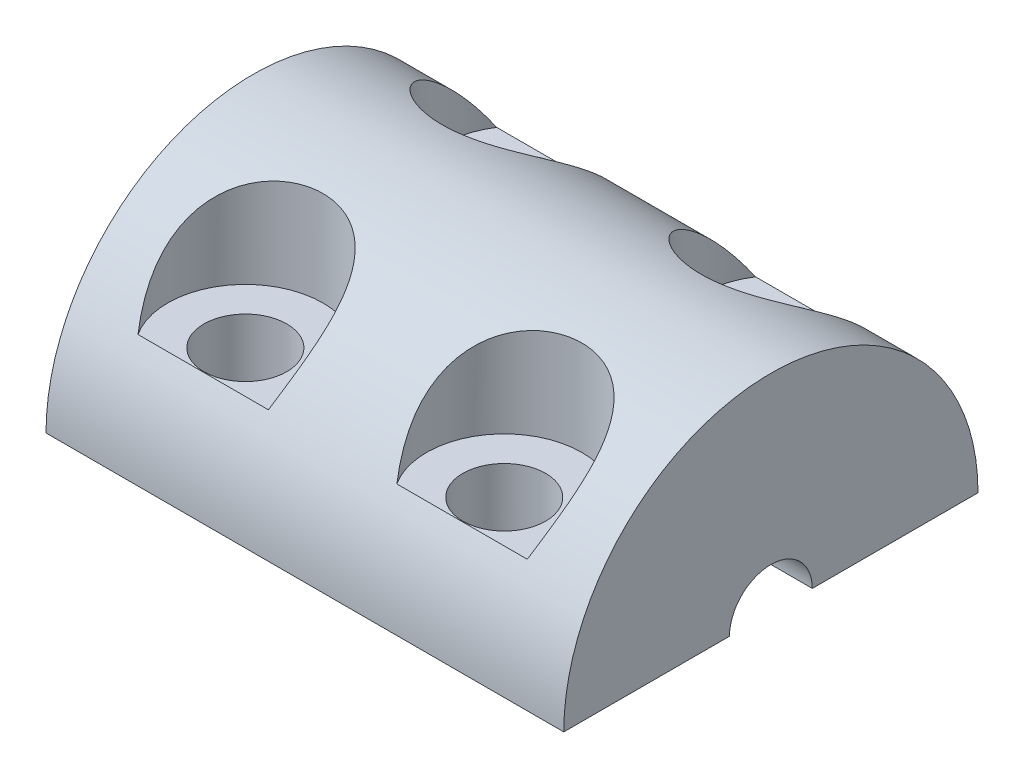
ISO-10303-21;
HEADER;
FILE_DESCRIPTION(('STEP AP214'),'2;1');
FILE_NAME('part.step','',(''),(''),'','','');
FILE_SCHEMA(('AUTOMOTIVE_DESIGN { 1 0 10303 214 1 1 1 1 }'));
ENDSEC;
DATA;
#1=APPLICATION_CONTEXT('core data for automotive mechanical design processes');
#2=APPLICATION_PROTOCOL_DEFINITION('international standard','automotive_design',2000,#1);
#3=PRODUCT_CONTEXT('',#1,'mechanical');
#4=PRODUCT('Part','Part','',(#3));
#5=PRODUCT_RELATED_PRODUCT_CATEGORY('part','',(#4));
#6=PRODUCT_DEFINITION_FORMATION('','',#4);
#7=PRODUCT_DEFINITION_CONTEXT('part definition',#1,'design');
#8=PRODUCT_DEFINITION('design','',#6,#7);
#9=PRODUCT_DEFINITION_SHAPE('','',#8);
#10=(LENGTH_UNIT() NAMED_UNIT(*) SI_UNIT(.MILLI.,.METRE.));
#11=(NAMED_UNIT(*) PLANE_ANGLE_UNIT() SI_UNIT($,.RADIAN.));
#12=(NAMED_UNIT(*) SI_UNIT($,.STERADIAN.) SOLID_ANGLE_UNIT());
#13=UNCERTAINTY_MEASURE_WITH_UNIT(LENGTH_MEASURE(1.E-05),#10,'distance_accuracy_value','');
#14=(GEOMETRIC_REPRESENTATION_CONTEXT(3) GLOBAL_UNCERTAINTY_ASSIGNED_CONTEXT((#13)) GLOBAL_UNIT_ASSIGNED_CONTEXT((#10,
#11,#12)) REPRESENTATION_CONTEXT('',''));
#15=CARTESIAN_POINT('',(0.,0.,0.));
#16=DIRECTION('',(0.,0.,1.));
#17=DIRECTION('',(1.,0.,0.));
#18=AXIS2_PLACEMENT_3D('',#15,#16,#17);
#19=CARTESIAN_POINT('',(-5.,10.,5.3));
#20=DIRECTION('',(0.,-1.,0.));
#21=DIRECTION('',(0.,0.,-1.));
#22=AXIS2_PLACEMENT_3D('',#19,#20,#21);
#23=CYLINDRICAL_SURFACE('',#22,1.6);
#24=CARTESIAN_POINT('',(-5.,0.,5.3));
#25=DIRECTION('',(0.,-1.,0.));
#26=DIRECTION('',(0.,0.,-1.));
#27=AXIS2_PLACEMENT_3D('',#24,#25,#26);
#28=CIRCLE('',#27,1.6);
#29=CARTESIAN_POINT('',(-5.,0.,3.7));
#30=VERTEX_POINT('',#29);
#31=EDGE_CURVE('E189',#30,#30,#28,.T.);
#32=ORIENTED_EDGE('',*,*,#31,.T.);
#33=EDGE_LOOP('',(#32));
#34=FACE_BOUND('',#33,.T.);
#35=CARTESIAN_POINT('',(-5.,4.,5.3));
#36=DIRECTION('',(0.,1.,0.));
#37=DIRECTION('',(0.,0.,1.));
#38=AXIS2_PLACEMENT_3D('',#35,#36,#37);
#39=CIRCLE('',#38,1.6);
#40=CARTESIAN_POINT('',(-5.,4.,6.9));
#41=VERTEX_POINT('',#40);
#42=EDGE_CURVE('E125',#41,#41,#39,.F.);
#43=ORIENTED_EDGE('',*,*,#42,.F.);
#44=EDGE_LOOP('',(#43));
#45=FACE_BOUND('',#44,.T.);
#46=ADVANCED_FACE('F39',(#34,#45),#23,.F.);
#47=CARTESIAN_POINT('',(5.,10.,5.3));
#48=DIRECTION('',(0.,-1.,0.));
#49=DIRECTION('',(0.,0.,-1.));
#50=AXIS2_PLACEMENT_3D('',#47,#48,#49);
#51=CYLINDRICAL_SURFACE('',#50,1.6);
#52=CARTESIAN_POINT('',(5.,0.,5.3));
#53=DIRECTION('',(0.,-1.,0.));
#54=DIRECTION('',(0.,0.,-1.));
#55=AXIS2_PLACEMENT_3D('',#52,#53,#54);
#56=CIRCLE('',#55,1.6);
#57=CARTESIAN_POINT('',(5.,0.,3.7));
#58=VERTEX_POINT('',#57);
#59=EDGE_CURVE('E293',#58,#58,#56,.T.);
#60=ORIENTED_EDGE('',*,*,#59,.T.);
#61=EDGE_LOOP('',(#60));
#62=FACE_BOUND('',#61,.T.);
#63=CARTESIAN_POINT('',(5.,4.,5.3));
#64=DIRECTION('',(0.,1.,0.));
#65=DIRECTION('',(0.,0.,1.));
#66=AXIS2_PLACEMENT_3D('',#63,#64,#65);
#67=CIRCLE('',#66,1.6);
#68=CARTESIAN_POINT('',(5.,4.,6.9));
#69=VERTEX_POINT('',#68);
#70=EDGE_CURVE('E126',#69,#69,#67,.F.);
#71=ORIENTED_EDGE('',*,*,#70,.F.);
#72=EDGE_LOOP('',(#71));
#73=FACE_BOUND('',#72,.T.);
#74=ADVANCED_FACE('F257',(#62,#73),#51,.F.);
#75=CARTESIAN_POINT('',(0.,0.,0.));
#76=DIRECTION('',(-1.,0.,0.));
#77=DIRECTION('',(0.,0.,1.));
#78=AXIS2_PLACEMENT_3D('',#75,#76,#77);
#79=PLANE('',#78);
#80=CARTESIAN_POINT('',(0.,0.,0.));
#81=DIRECTION('',(1.,0.,0.));
#82=DIRECTION('',(0.,0.,-1.));
#83=AXIS2_PLACEMENT_3D('',#80,#81,#82);
#84=CIRCLE('',#83,2.6);
#85=CARTESIAN_POINT('',(0.,0.,-2.6));
#86=VERTEX_POINT('',#85);
#87=CARTESIAN_POINT('',(0.,0.,2.6));
#88=VERTEX_POINT('',#87);
#89=EDGE_CURVE('E185',#86,#88,#84,.T.);
#90=ORIENTED_EDGE('',*,*,#89,.F.);
#91=DIRECTION('',(0.,0.,-1.));
#92=VECTOR('',#91,1.);
#93=CARTESIAN_POINT('',(0.,0.,-1.6));
#94=LINE('',#93,#92);
#95=CARTESIAN_POINT('',(0.,0.,-1.6));
#96=VERTEX_POINT('',#95);
#97=EDGE_CURVE('E198',#96,#86,#94,.T.);
#98=ORIENTED_EDGE('',*,*,#97,.F.);
#99=CARTESIAN_POINT('',(0.,0.,0.));
#100=DIRECTION('',(-1.,0.,0.));
#101=DIRECTION('',(0.,0.,1.));
#102=AXIS2_PLACEMENT_3D('',#99,#100,#101);
#103=CIRCLE('',#102,1.6);
#104=CARTESIAN_POINT('',(0.,0.,1.6));
#105=VERTEX_POINT('',#104);
#106=EDGE_CURVE('E208',#105,#96,#103,.T.);
#107=ORIENTED_EDGE('',*,*,#106,.F.);
#108=DIRECTION('',(0.,0.,-1.));
#109=VECTOR('',#108,1.);
#110=CARTESIAN_POINT('',(0.,0.,8.));
#111=LINE('',#110,#109);
#112=EDGE_CURVE('E194',#88,#105,#111,.T.);
#113=ORIENTED_EDGE('',*,*,#112,.F.);
#114=EDGE_LOOP('',(#90,#98,#107,#113));
#115=FACE_BOUND('',#114,.T.);
#116=ADVANCED_FACE('F135',(#115),#79,.T.);
#117=CARTESIAN_POINT('',(10.,0.,0.));
#118=DIRECTION('',(-1.,0.,0.));
#119=DIRECTION('',(0.,0.,1.));
#120=AXIS2_PLACEMENT_3D('',#117,#118,#119);
#121=CYLINDRICAL_SURFACE('',#120,8.);
#122=DIRECTION('',(-1.,0.,0.));
#123=VECTOR('',#122,1.);
#124=CARTESIAN_POINT('',(10.,4.,6.92820323027551));
#125=LINE('',#124,#123);
#126=CARTESIAN_POINT('',(2.48028687328887,4.,6.92820323027551));
#127=VERTEX_POINT('',#126);
#128=CARTESIAN_POINT('',(7.51971312671113,4.,6.92820323027551));
#129=VERTEX_POINT('',#128);
#130=EDGE_CURVE('E121',#127,#129,#125,.F.);
#131=ORIENTED_EDGE('',*,*,#130,.F.);
#132=CARTESIAN_POINT('',(2.48028687328887,4.,6.92820323027551));
#133=CARTESIAN_POINT('',(2.42268432999207,4.15447094658286,6.83901770608216));
#134=CARTESIAN_POINT('',(2.36805276425493,4.30691430076104,6.74411586178259));
#135=CARTESIAN_POINT('',(2.26703938800955,4.60748607622435,6.5424738631374));
#136=CARTESIAN_POINT('',(2.22068939040642,4.75559610464146,6.43569051085766));
#137=CARTESIAN_POINT('',(2.13850878615933,5.04787842959176,6.20914603531687));
#138=CARTESIAN_POINT('',(2.1028166248965,5.19197855141819,6.08923963017592));
#139=CARTESIAN_POINT('',(2.04587390447653,5.47270389446106,5.83823069332525));
#140=CARTESIAN_POINT('',(2.02459857240118,5.60934156518667,5.70714780526658));
#141=CARTESIAN_POINT('',(1.9982635506114,5.89137495297147,5.41643556945201));
#142=CARTESIAN_POINT('',(1.99572272413871,6.03553631395531,5.25532422907641));
#143=CARTESIAN_POINT('',(2.01323090911154,6.24065791277609,5.00657304580275));
#144=CARTESIAN_POINT('',(2.0225929368339,6.30709517052098,4.92259481886254));
#145=CARTESIAN_POINT('',(2.04907004215929,6.43597960748785,4.75284032539089));
#146=CARTESIAN_POINT('',(2.06618137059281,6.49842869956293,4.66706494745149));
#147=CARTESIAN_POINT('',(2.10906952238112,6.61973144890119,4.49338680477556));
#148=CARTESIAN_POINT('',(2.13495611621068,6.67852780472331,4.40547088018539));
#149=CARTESIAN_POINT('',(2.19587521188576,6.79120514315229,4.22970684358536));
#150=CARTESIAN_POINT('',(2.23090266592469,6.84508881657105,4.14185872090387));
#151=CARTESIAN_POINT('',(2.31049779230545,6.94764818206895,3.9674202906169));
#152=CARTESIAN_POINT('',(2.35506642216122,6.99632335070767,3.88083011018547));
#153=CARTESIAN_POINT('',(2.45389602415372,7.08821844322346,3.71032806614034));
#154=CARTESIAN_POINT('',(2.50815489736285,7.1314395450102,3.62641562715219));
#155=CARTESIAN_POINT('',(2.61739968892661,7.20626979331868,3.47501200241172));
#156=CARTESIAN_POINT('',(2.67106135109019,7.2386487021071,3.40694276933439));
#157=CARTESIAN_POINT('',(2.78506704409809,7.29941000758085,3.27473733054404));
#158=CARTESIAN_POINT('',(2.84541011597567,7.32779297646896,3.21060056246159));
#159=CARTESIAN_POINT('',(2.97238950457947,7.38064398797913,3.08716745970697));
#160=CARTESIAN_POINT('',(3.03902329740512,7.40511359015702,3.02786920142844));
#161=CARTESIAN_POINT('',(3.17806320072035,7.45029608280649,2.91492504455724));
#162=CARTESIAN_POINT('',(3.2504688834279,7.47100925131316,2.8612787277554));
#163=CARTESIAN_POINT('',(3.45867132233583,7.52356328820207,2.72124353125883));
#164=CARTESIAN_POINT('',(3.60013956503145,7.55160105597473,2.64166737565624));
#165=CARTESIAN_POINT('',(3.89532613736512,7.5976871222936,2.50605714205903));
#166=CARTESIAN_POINT('',(4.04904192750722,7.61573748556666,2.45001819872164));
#167=CARTESIAN_POINT('',(4.36130418796871,7.64274941122668,2.36439537735816));
#168=CARTESIAN_POINT('',(4.519705298661,7.65187563254407,2.33433346067784));
#169=CARTESIAN_POINT('',(4.83953057961002,7.66227282608811,2.29997954278911));
#170=CARTESIAN_POINT('',(5.00095482047,7.66354361462614,2.29568814418931));
#171=CARTESIAN_POINT('',(5.32281201338204,7.65831982863428,2.31305361557592));
#172=CARTESIAN_POINT('',(5.48323994504571,7.6517996477444,2.33479605071843));
#173=CARTESIAN_POINT('',(5.79799904462902,7.63046535931846,2.40359779980164));
#174=CARTESIAN_POINT('',(5.95233037620224,7.61565147457593,2.4506564336727));
#175=CARTESIAN_POINT('',(6.25036030760944,7.57678651691918,2.56829045970917));
#176=CARTESIAN_POINT('',(6.39406792361095,7.55274338657954,2.63884562415555));
#177=CARTESIAN_POINT('',(6.66691783910946,7.49423054050831,2.80069255910053));
#178=CARTESIAN_POINT('',(6.79606219470117,7.45976229916879,2.89198139684374));
#179=CARTESIAN_POINT('',(7.03613625575949,7.37939391480767,3.09128218490966));
#180=CARTESIAN_POINT('',(7.1471057479925,7.33351931175902,3.19925657291016));
#181=CARTESIAN_POINT('',(7.34882275601001,7.2296546740147,3.42750458612365));
#182=CARTESIAN_POINT('',(7.43956982137732,7.1716643695199,3.54777848519849));
#183=CARTESIAN_POINT('',(7.60191183192957,7.04188272843657,3.79899569324676));
#184=CARTESIAN_POINT('',(7.67294038003326,6.96976856860378,3.9301364022825));
#185=CARTESIAN_POINT('',(7.79296839169247,6.81350096140523,4.19522396374092));
#186=CARTESIAN_POINT('',(7.84196082635095,6.72934368389253,4.32917169728656));
#187=CARTESIAN_POINT('',(7.92347184470533,6.54093640668726,4.60950495592138));
#188=CARTESIAN_POINT('',(7.95375414084308,6.43550768418578,4.75573921389694));
#189=CARTESIAN_POINT('',(7.99242772121922,6.2134346472508,5.04243704306947));
#190=CARTESIAN_POINT('',(8.00080533846134,6.09678337775865,5.18289695771715));
#191=CARTESIAN_POINT('',(7.99924753439151,5.87873475717501,5.42786597964082));
#192=CARTESIAN_POINT('',(7.99266145111276,5.77899879322946,5.5339170004334));
#193=CARTESIAN_POINT('',(7.96938107763156,5.57444664489626,5.73991449921052));
#194=CARTESIAN_POINT('',(7.952681261077,5.46962771189633,5.83985760681233));
#195=CARTESIAN_POINT('',(7.91067846859407,5.25545315674558,6.03333238314348));
#196=CARTESIAN_POINT('',(7.88535476696037,5.1460871678434,6.12684794776054));
#197=CARTESIAN_POINT('',(7.82754036373616,4.92369791124493,6.3069539029306));
#198=CARTESIAN_POINT('',(7.79505188851142,4.81067578893648,6.39354643336792));
#199=CARTESIAN_POINT('',(7.72454015083066,4.5825974047171,6.5589213091643));
#200=CARTESIAN_POINT('',(7.68657637101598,4.4675734034555,6.63777396539814));
#201=CARTESIAN_POINT('',(7.60621655289593,4.23542631714525,6.78823797563214));
#202=CARTESIAN_POINT('',(7.56384828336638,4.11831983130072,6.85988969195654));
#203=CARTESIAN_POINT('',(7.51971312671113,4.,6.92820323027551));
#204=B_SPLINE_CURVE_WITH_KNOTS('',3,(#132,#133,#134,#135,#136,#137,#138,#139,#140,#141,#142,
#143,#144,#145,#146,#147,#148,#149,#150,#151,#152,#153,#154,#155,#156,#157,#158,#159,#160,#161,
#162,#163,#164,#165,#166,#167,#168,#169,#170,#171,#172,#173,#174,#175,#176,#177,#178,#179,#180,
#181,#182,#183,#184,#185,#186,#187,#188,#189,#190,#191,#192,#193,#194,#195,#196,#197,#198,#199,
#200,#201,#202,#203),.UNSPECIFIED.,.F.,.F.,(4,2,2,2,2,2,2,2,2,2,2,2,2,2,2,2,2,2,2,2,2,2,2,2,2,2,
2,2,2,2,2,2,2,2,2,4),(0.,0.562399060957532,1.12691413633078,1.69847166933727,2.269044568457,
2.91513417866207,3.2372999980264,3.55931011740014,3.88550679354049,4.21152371568245,
4.53757337091836,4.86355248856126,5.14074268787318,5.41789315418481,5.6949328937076,
5.971952119562,6.46347917234534,6.95490457222631,7.4370812876874,7.91926927815306,
8.40304643109156,8.88681058896195,9.37015935537553,9.85343979516749,10.3356477162355,
10.8178663765202,11.3127659259637,11.8078232226146,12.3542384003735,12.9009944219388,
13.3376006693273,13.7744457028812,14.2123480992988,14.6501146141539,15.0834408020748,
15.5141840127637),.UNSPECIFIED.);
#205=EDGE_CURVE('E11',#127,#129,#204,.T.);
#206=ORIENTED_EDGE('',*,*,#205,.T.);
#207=EDGE_LOOP('',(#131,#206));
#208=FACE_BOUND('',#207,.T.);
#209=DIRECTION('',(-1.,0.,0.));
#210=VECTOR('',#209,1.);
#211=CARTESIAN_POINT('',(10.,4.,6.92820323027551));
#212=LINE('',#211,#210);
#213=CARTESIAN_POINT('',(-7.51971312671113,4.,6.92820323027551));
#214=VERTEX_POINT('',#213);
#215=CARTESIAN_POINT('',(-2.48028687328887,4.,6.92820323027551));
#216=VERTEX_POINT('',#215);
#217=EDGE_CURVE('E139',#214,#216,#212,.F.);
#218=ORIENTED_EDGE('',*,*,#217,.F.);
#219=CARTESIAN_POINT('',(-7.51971312671113,4.,6.92820323027551));
#220=CARTESIAN_POINT('',(-7.57731567000793,4.15447094658286,6.83901770608216));
#221=CARTESIAN_POINT('',(-7.63194723574507,4.30691430076104,6.74411586178259));
#222=CARTESIAN_POINT('',(-7.73296061199045,4.60748607622435,6.5424738631374));
#223=CARTESIAN_POINT('',(-7.77931060959359,4.75559610464146,6.43569051085766));
#224=CARTESIAN_POINT('',(-7.86149121384067,5.04787842959176,6.20914603531687));
#225=CARTESIAN_POINT('',(-7.8971833751035,5.19197855141819,6.08923963017592));
#226=CARTESIAN_POINT('',(-7.95412609552347,5.47270389446106,5.83823069332525));
#227=CARTESIAN_POINT('',(-7.97540142759882,5.60934156518667,5.70714780526658));
#228=CARTESIAN_POINT('',(-8.0017364493886,5.89137495297147,5.41643556945201));
#229=CARTESIAN_POINT('',(-8.00427727586129,6.03553631395531,5.25532422907641));
#230=CARTESIAN_POINT('',(-7.98676909088846,6.24065791277609,5.00657304580275));
#231=CARTESIAN_POINT('',(-7.9774070631661,6.30709517052098,4.92259481886253));
#232=CARTESIAN_POINT('',(-7.95092995784071,6.43597960748785,4.75284032539089));
#233=CARTESIAN_POINT('',(-7.93381862940719,6.49842869956293,4.66706494745149));
#234=CARTESIAN_POINT('',(-7.89093047761888,6.61973144890119,4.49338680477556));
#235=CARTESIAN_POINT('',(-7.86504388378932,6.67852780472331,4.40547088018539));
#236=CARTESIAN_POINT('',(-7.80412478811424,6.79120514315229,4.22970684358536));
#237=CARTESIAN_POINT('',(-7.76909733407531,6.84508881657105,4.14185872090387));
#238=CARTESIAN_POINT('',(-7.68950220769455,6.94764818206895,3.9674202906169));
#239=CARTESIAN_POINT('',(-7.64493357783878,6.99632335070767,3.88083011018547));
#240=CARTESIAN_POINT('',(-7.54610397584628,7.08821844322346,3.71032806614034));
#241=CARTESIAN_POINT('',(-7.49184510263715,7.1314395450102,3.62641562715219));
#242=CARTESIAN_POINT('',(-7.38260031107339,7.20626979331868,3.47501200241172));
#243=CARTESIAN_POINT('',(-7.32893864890981,7.2386487021071,3.40694276933439));
#244=CARTESIAN_POINT('',(-7.21493295590191,7.29941000758085,3.27473733054404));
#245=CARTESIAN_POINT('',(-7.15458988402432,7.32779297646896,3.21060056246159));
#246=CARTESIAN_POINT('',(-7.02761049542053,7.38064398797913,3.08716745970697));
#247=CARTESIAN_POINT('',(-6.96097670259488,7.40511359015702,3.02786920142844));
#248=CARTESIAN_POINT('',(-6.82193679927965,7.45029608280649,2.91492504455724));
#249=CARTESIAN_POINT('',(-6.7495311165721,7.47100925131316,2.8612787277554));
#250=CARTESIAN_POINT('',(-6.54132867766416,7.52356328820207,2.72124353125883));
#251=CARTESIAN_POINT('',(-6.39986043496855,7.55160105597473,2.64166737565624));
#252=CARTESIAN_POINT('',(-6.10467386263488,7.5976871222936,2.50605714205903));
#253=CARTESIAN_POINT('',(-5.95095807249278,7.61573748556666,2.45001819872164));
#254=CARTESIAN_POINT('',(-5.63869581203129,7.64274941122668,2.36439537735816));
#255=CARTESIAN_POINT('',(-5.480294701339,7.65187563254407,2.33433346067784));
#256=CARTESIAN_POINT('',(-5.16046942038998,7.66227282608811,2.29997954278911));
#257=CARTESIAN_POINT('',(-4.99904517953,7.66354361462614,2.29568814418931));
#258=CARTESIAN_POINT('',(-4.67718798661796,7.65831982863428,2.31305361557592));
#259=CARTESIAN_POINT('',(-4.51676005495429,7.6517996477444,2.33479605071843));
#260=CARTESIAN_POINT('',(-4.20200095537098,7.63046535931846,2.40359779980164));
#261=CARTESIAN_POINT('',(-4.04766962379776,7.61565147457593,2.4506564336727));
#262=CARTESIAN_POINT('',(-3.74963969239056,7.57678651691918,2.56829045970917));
#263=CARTESIAN_POINT('',(-3.60593207638905,7.55274338657954,2.63884562415555));
#264=CARTESIAN_POINT('',(-3.33308216089054,7.49423054050831,2.80069255910053));
#265=CARTESIAN_POINT('',(-3.20393780529883,7.45976229916879,2.89198139684374));
#266=CARTESIAN_POINT('',(-2.96386374424051,7.37939391480767,3.09128218490966));
#267=CARTESIAN_POINT('',(-2.8528942520075,7.33351931175902,3.19925657291016));
#268=CARTESIAN_POINT('',(-2.65117724398999,7.2296546740147,3.42750458612365));
#269=CARTESIAN_POINT('',(-2.56043017862268,7.1716643695199,3.54777848519849));
#270=CARTESIAN_POINT('',(-2.39808816807043,7.04188272843657,3.79899569324676));
#271=CARTESIAN_POINT('',(-2.32705961996674,6.96976856860378,3.9301364022825));
#272=CARTESIAN_POINT('',(-2.20703160830753,6.81350096140523,4.19522396374092));
#273=CARTESIAN_POINT('',(-2.15803917364905,6.72934368389253,4.32917169728656));
#274=CARTESIAN_POINT('',(-2.07652815529467,6.54093640668726,4.60950495592138));
#275=CARTESIAN_POINT('',(-2.04624585915692,6.43550768418578,4.75573921389694));
#276=CARTESIAN_POINT('',(-2.00757227878078,6.2134346472508,5.04243704306946));
#277=CARTESIAN_POINT('',(-1.99919466153866,6.09678337775865,5.18289695771715));
#278=CARTESIAN_POINT('',(-2.00075246560849,5.87873475717501,5.42786597964082));
#279=CARTESIAN_POINT('',(-2.00733854888724,5.77899879322946,5.5339170004334));
#280=CARTESIAN_POINT('',(-2.03061892236844,5.57444664489625,5.73991449921052));
#281=CARTESIAN_POINT('',(-2.047318738923,5.46962771189633,5.83985760681233));
#282=CARTESIAN_POINT('',(-2.08932153140593,5.25545315674558,6.03333238314348));
#283=CARTESIAN_POINT('',(-2.11464523303963,5.1460871678434,6.12684794776054));
#284=CARTESIAN_POINT('',(-2.17245963626384,4.92369791124493,6.3069539029306));
#285=CARTESIAN_POINT('',(-2.20494811148858,4.81067578893648,6.39354643336792));
#286=CARTESIAN_POINT('',(-2.27545984916934,4.5825974047171,6.5589213091643));
#287=CARTESIAN_POINT('',(-2.31342362898402,4.4675734034555,6.63777396539814));
#288=CARTESIAN_POINT('',(-2.39378344710407,4.23542631714525,6.78823797563214));
#289=CARTESIAN_POINT('',(-2.43615171663362,4.11831983130073,6.85988969195654));
#290=CARTESIAN_POINT('',(-2.48028687328887,4.,6.92820323027551));
#291=B_SPLINE_CURVE_WITH_KNOTS('',3,(#219,#220,#221,#222,#223,#224,#225,#226,#227,#228,#229,
#230,#231,#232,#233,#234,#235,#236,#237,#238,#239,#240,#241,#242,#243,#244,#245,#246,#247,#248,
#249,#250,#251,#252,#253,#254,#255,#256,#257,#258,#259,#260,#261,#262,#263,#264,#265,#266,#267,
#268,#269,#270,#271,#272,#273,#274,#275,#276,#277,#278,#279,#280,#281,#282,#283,#284,#285,#286,
#287,#288,#289,#290),.UNSPECIFIED.,.F.,.F.,(4,2,2,2,2,2,2,2,2,2,2,2,2,2,2,2,2,2,2,2,2,2,2,2,2,2,
2,2,2,2,2,2,2,2,2,4),(0.,0.562399060957532,1.12691413633078,1.69847166933727,2.269044568457,
2.91513417866207,3.2372999980264,3.55931011740015,3.88550679354049,4.21152371568245,
4.53757337091837,4.86355248856126,5.14074268787318,5.41789315418482,5.6949328937076,
5.971952119562,6.46347917234534,6.95490457222631,7.4370812876874,7.91926927815306,
8.40304643109156,8.88681058896195,9.37015935537553,9.8534397951675,10.3356477162355,
10.8178663765202,11.3127659259637,11.8078232226146,12.3542384003735,12.9009944219388,
13.3376006693273,13.7744457028812,14.2123480992988,14.6501146141539,15.0834408020748,
15.5141840127637),.UNSPECIFIED.);
#292=EDGE_CURVE('E54',#214,#216,#291,.T.);
#293=ORIENTED_EDGE('',*,*,#292,.T.);
#294=EDGE_LOOP('',(#218,#293));
#295=FACE_BOUND('',#294,.T.);
#296=DIRECTION('',(-1.,0.,0.));
#297=VECTOR('',#296,1.);
#298=CARTESIAN_POINT('',(10.,4.,-6.92820323027551));
#299=LINE('',#298,#297);
#300=CARTESIAN_POINT('',(-7.51971312671113,4.,-6.92820323027551));
#301=VERTEX_POINT('',#300);
#302=CARTESIAN_POINT('',(-2.48028687328887,4.,-6.92820323027551));
#303=VERTEX_POINT('',#302);
#304=EDGE_CURVE('E143',#301,#303,#299,.F.);
#305=ORIENTED_EDGE('',*,*,#304,.T.);
#306=CARTESIAN_POINT('',(-2.48028687328887,4.,-6.92820323027551));
#307=CARTESIAN_POINT('',(-2.42268432999207,4.15447094658286,-6.83901770608216));
#308=CARTESIAN_POINT('',(-2.36805276425493,4.30691430076104,-6.74411586178259));
#309=CARTESIAN_POINT('',(-2.26703938800955,4.60748607622435,-6.5424738631374));
#310=CARTESIAN_POINT('',(-2.22068939040642,4.75559610464146,-6.43569051085766));
#311=CARTESIAN_POINT('',(-2.13850878615933,5.04787842959176,-6.20914603531687));
#312=CARTESIAN_POINT('',(-2.1028166248965,5.19197855141819,-6.08923963017592));
#313=CARTESIAN_POINT('',(-2.04587390447653,5.47270389446106,-5.83823069332525));
#314=CARTESIAN_POINT('',(-2.02459857240118,5.60934156518667,-5.70714780526658));
#315=CARTESIAN_POINT('',(-1.9982635506114,5.89137495297147,-5.41643556945201));
#316=CARTESIAN_POINT('',(-1.99572272413871,6.03553631395531,-5.25532422907641));
#317=CARTESIAN_POINT('',(-2.01323090911154,6.24065791277609,-5.00657304580275));
#318=CARTESIAN_POINT('',(-2.0225929368339,6.30709517052098,-4.92259481886254));
#319=CARTESIAN_POINT('',(-2.04907004215929,6.43597960748785,-4.75284032539089));
#320=CARTESIAN_POINT('',(-2.06618137059281,6.49842869956293,-4.66706494745149));
#321=CARTESIAN_POINT('',(-2.10906952238112,6.61973144890119,-4.49338680477556));
#322=CARTESIAN_POINT('',(-2.13495611621068,6.67852780472331,-4.40547088018539));
#323=CARTESIAN_POINT('',(-2.19587521188576,6.79120514315229,-4.22970684358536));
#324=CARTESIAN_POINT('',(-2.23090266592469,6.84508881657105,-4.14185872090387));
#325=CARTESIAN_POINT('',(-2.31049779230545,6.94764818206895,-3.9674202906169));
#326=CARTESIAN_POINT('',(-2.35506642216122,6.99632335070767,-3.88083011018547));
#327=CARTESIAN_POINT('',(-2.45389602415372,7.08821844322346,-3.71032806614034));
#328=CARTESIAN_POINT('',(-2.50815489736285,7.1314395450102,-3.62641562715219));
#329=CARTESIAN_POINT('',(-2.61739968892661,7.20626979331868,-3.47501200241172));
#330=CARTESIAN_POINT('',(-2.67106135109019,7.2386487021071,-3.40694276933439));
#331=CARTESIAN_POINT('',(-2.78506704409809,7.29941000758085,-3.27473733054404));
#332=CARTESIAN_POINT('',(-2.84541011597567,7.32779297646896,-3.21060056246159));
#333=CARTESIAN_POINT('',(-2.97238950457947,7.38064398797913,-3.08716745970697));
#334=CARTESIAN_POINT('',(-3.03902329740512,7.40511359015702,-3.02786920142844));
#335=CARTESIAN_POINT('',(-3.17806320072035,7.45029608280649,-2.91492504455724));
#336=CARTESIAN_POINT('',(-3.2504688834279,7.47100925131316,-2.8612787277554));
#337=CARTESIAN_POINT('',(-3.45867132233583,7.52356328820207,-2.72124353125883));
#338=CARTESIAN_POINT('',(-3.60013956503145,7.55160105597473,-2.64166737565624));
#339=CARTESIAN_POINT('',(-3.89532613736512,7.5976871222936,-2.50605714205903));
#340=CARTESIAN_POINT('',(-4.04904192750722,7.61573748556666,-2.45001819872164));
#341=CARTESIAN_POINT('',(-4.36130418796871,7.64274941122668,-2.36439537735816));
#342=CARTESIAN_POINT('',(-4.519705298661,7.65187563254407,-2.33433346067784));
#343=CARTESIAN_POINT('',(-4.83953057961002,7.66227282608811,-2.29997954278911));
#344=CARTESIAN_POINT('',(-5.00095482047,7.66354361462614,-2.29568814418931));
#345=CARTESIAN_POINT('',(-5.32281201338204,7.65831982863428,-2.31305361557592));
#346=CARTESIAN_POINT('',(-5.48323994504571,7.6517996477444,-2.33479605071843));
#347=CARTESIAN_POINT('',(-5.79799904462902,7.63046535931846,-2.40359779980164));
#348=CARTESIAN_POINT('',(-5.95233037620224,7.61565147457593,-2.4506564336727));
#349=CARTESIAN_POINT('',(-6.25036030760944,7.57678651691918,-2.56829045970917));
#350=CARTESIAN_POINT('',(-6.39406792361095,7.55274338657954,-2.63884562415555));
#351=CARTESIAN_POINT('',(-6.66691783910946,7.49423054050831,-2.80069255910053));
#352=CARTESIAN_POINT('',(-6.79606219470117,7.45976229916879,-2.89198139684374));
#353=CARTESIAN_POINT('',(-7.03613625575949,7.37939391480767,-3.09128218490966));
#354=CARTESIAN_POINT('',(-7.1471057479925,7.33351931175902,-3.19925657291016));
#355=CARTESIAN_POINT('',(-7.34882275601001,7.2296546740147,-3.42750458612365));
#356=CARTESIAN_POINT('',(-7.43956982137732,7.1716643695199,-3.54777848519849));
#357=CARTESIAN_POINT('',(-7.60191183192957,7.04188272843657,-3.79899569324676));
#358=CARTESIAN_POINT('',(-7.67294038003326,6.96976856860378,-3.9301364022825));
#359=CARTESIAN_POINT('',(-7.79296839169247,6.81350096140523,-4.19522396374092));
#360=CARTESIAN_POINT('',(-7.84196082635095,6.72934368389253,-4.32917169728656));
#361=CARTESIAN_POINT('',(-7.92347184470533,6.54093640668726,-4.60950495592138));
#362=CARTESIAN_POINT('',(-7.95375414084308,6.43550768418578,-4.75573921389694));
#363=CARTESIAN_POINT('',(-7.99242772121922,6.2134346472508,-5.04243704306947));
#364=CARTESIAN_POINT('',(-8.00080533846134,6.09678337775865,-5.18289695771715));
#365=CARTESIAN_POINT('',(-7.99924753439151,5.87873475717501,-5.42786597964082));
#366=CARTESIAN_POINT('',(-7.99266145111276,5.77899879322946,-5.5339170004334));
#367=CARTESIAN_POINT('',(-7.96938107763156,5.57444664489626,-5.73991449921052));
#368=CARTESIAN_POINT('',(-7.952681261077,5.46962771189633,-5.83985760681233));
#369=CARTESIAN_POINT('',(-7.91067846859407,5.25545315674558,-6.03333238314348));
#370=CARTESIAN_POINT('',(-7.88535476696037,5.1460871678434,-6.12684794776054));
#371=CARTESIAN_POINT('',(-7.82754036373616,4.92369791124493,-6.3069539029306));
#372=CARTESIAN_POINT('',(-7.79505188851142,4.81067578893648,-6.39354643336792));
#373=CARTESIAN_POINT('',(-7.72454015083066,4.5825974047171,-6.5589213091643));
#374=CARTESIAN_POINT('',(-7.68657637101598,4.4675734034555,-6.63777396539814));
#375=CARTESIAN_POINT('',(-7.60621655289593,4.23542631714525,-6.78823797563214));
#376=CARTESIAN_POINT('',(-7.56384828336638,4.11831983130072,-6.85988969195654));
#377=CARTESIAN_POINT('',(-7.51971312671113,4.,-6.92820323027551));
#378=B_SPLINE_CURVE_WITH_KNOTS('',3,(#306,#307,#308,#309,#310,#311,#312,#313,#314,#315,#316,
#317,#318,#319,#320,#321,#322,#323,#324,#325,#326,#327,#328,#329,#330,#331,#332,#333,#334,#335,
#336,#337,#338,#339,#340,#341,#342,#343,#344,#345,#346,#347,#348,#349,#350,#351,#352,#353,#354,
#355,#356,#357,#358,#359,#360,#361,#362,#363,#364,#365,#366,#367,#368,#369,#370,#371,#372,#373,
#374,#375,#376,#377),.UNSPECIFIED.,.F.,.F.,(4,2,2,2,2,2,2,2,2,2,2,2,2,2,2,2,2,2,2,2,2,2,2,2,2,2,
2,2,2,2,2,2,2,2,2,4),(0.,0.562399060957532,1.12691413633078,1.69847166933727,2.269044568457,
2.91513417866207,3.2372999980264,3.55931011740014,3.88550679354049,4.21152371568245,
4.53757337091836,4.86355248856126,5.14074268787318,5.41789315418481,5.6949328937076,
5.971952119562,6.46347917234534,6.95490457222631,7.4370812876874,7.91926927815306,
8.40304643109156,8.88681058896195,9.37015935537553,9.85343979516749,10.3356477162355,
10.8178663765202,11.3127659259637,11.8078232226146,12.3542384003735,12.9009944219388,
13.3376006693273,13.7744457028812,14.2123480992988,14.6501146141539,15.0834408020748,
15.5141840127637),.UNSPECIFIED.);
#379=EDGE_CURVE('E238',#303,#301,#378,.T.);
#380=ORIENTED_EDGE('',*,*,#379,.T.);
#381=EDGE_LOOP('',(#305,#380));
#382=FACE_BOUND('',#381,.T.);
#383=DIRECTION('',(-1.,0.,0.));
#384=VECTOR('',#383,1.);
#385=CARTESIAN_POINT('',(10.,4.,-6.92820323027551));
#386=LINE('',#385,#384);
#387=CARTESIAN_POINT('',(2.48028687328887,4.,-6.92820323027551));
#388=VERTEX_POINT('',#387);
#389=CARTESIAN_POINT('',(7.51971312671113,4.,-6.92820323027551));
#390=VERTEX_POINT('',#389);
#391=EDGE_CURVE('E147',#388,#390,#386,.F.);
#392=ORIENTED_EDGE('',*,*,#391,.T.);
#393=CARTESIAN_POINT('',(7.51971312671113,4.,-6.92820323027551));
#394=CARTESIAN_POINT('',(7.57731567000793,4.15447094658286,-6.83901770608216));
#395=CARTESIAN_POINT('',(7.63194723574507,4.30691430076104,-6.74411586178259));
#396=CARTESIAN_POINT('',(7.73296061199045,4.60748607622435,-6.5424738631374));
#397=CARTESIAN_POINT('',(7.77931060959359,4.75559610464146,-6.43569051085766));
#398=CARTESIAN_POINT('',(7.86149121384067,5.04787842959176,-6.20914603531687));
#399=CARTESIAN_POINT('',(7.8971833751035,5.19197855141819,-6.08923963017592));
#400=CARTESIAN_POINT('',(7.95412609552347,5.47270389446106,-5.83823069332525));
#401=CARTESIAN_POINT('',(7.97540142759882,5.60934156518667,-5.70714780526658));
#402=CARTESIAN_POINT('',(8.0017364493886,5.89137495297147,-5.41643556945201));
#403=CARTESIAN_POINT('',(8.00427727586129,6.03553631395531,-5.25532422907641));
#404=CARTESIAN_POINT('',(7.98676909088846,6.24065791277609,-5.00657304580275));
#405=CARTESIAN_POINT('',(7.9774070631661,6.30709517052098,-4.92259481886253));
#406=CARTESIAN_POINT('',(7.95092995784071,6.43597960748785,-4.75284032539089));
#407=CARTESIAN_POINT('',(7.93381862940719,6.49842869956293,-4.66706494745149));
#408=CARTESIAN_POINT('',(7.89093047761888,6.61973144890119,-4.49338680477556));
#409=CARTESIAN_POINT('',(7.86504388378932,6.67852780472331,-4.40547088018539));
#410=CARTESIAN_POINT('',(7.80412478811424,6.79120514315229,-4.22970684358536));
#411=CARTESIAN_POINT('',(7.76909733407531,6.84508881657105,-4.14185872090387));
#412=CARTESIAN_POINT('',(7.68950220769455,6.94764818206895,-3.9674202906169));
#413=CARTESIAN_POINT('',(7.64493357783878,6.99632335070767,-3.88083011018547));
#414=CARTESIAN_POINT('',(7.54610397584628,7.08821844322346,-3.71032806614034));
#415=CARTESIAN_POINT('',(7.49184510263715,7.1314395450102,-3.62641562715219));
#416=CARTESIAN_POINT('',(7.38260031107339,7.20626979331868,-3.47501200241172));
#417=CARTESIAN_POINT('',(7.32893864890981,7.2386487021071,-3.40694276933439));
#418=CARTESIAN_POINT('',(7.21493295590191,7.29941000758085,-3.27473733054404));
#419=CARTESIAN_POINT('',(7.15458988402432,7.32779297646896,-3.21060056246159));
#420=CARTESIAN_POINT('',(7.02761049542053,7.38064398797913,-3.08716745970697));
#421=CARTESIAN_POINT('',(6.96097670259488,7.40511359015702,-3.02786920142844));
#422=CARTESIAN_POINT('',(6.82193679927965,7.45029608280649,-2.91492504455724));
#423=CARTESIAN_POINT('',(6.7495311165721,7.47100925131316,-2.8612787277554));
#424=CARTESIAN_POINT('',(6.54132867766416,7.52356328820207,-2.72124353125883));
#425=CARTESIAN_POINT('',(6.39986043496855,7.55160105597473,-2.64166737565624));
#426=CARTESIAN_POINT('',(6.10467386263488,7.5976871222936,-2.50605714205903));
#427=CARTESIAN_POINT('',(5.95095807249278,7.61573748556666,-2.45001819872164));
#428=CARTESIAN_POINT('',(5.63869581203129,7.64274941122668,-2.36439537735816));
#429=CARTESIAN_POINT('',(5.480294701339,7.65187563254407,-2.33433346067784));
#430=CARTESIAN_POINT('',(5.16046942038998,7.66227282608811,-2.29997954278911));
#431=CARTESIAN_POINT('',(4.99904517953,7.66354361462614,-2.29568814418931));
#432=CARTESIAN_POINT('',(4.67718798661796,7.65831982863428,-2.31305361557592));
#433=CARTESIAN_POINT('',(4.51676005495429,7.6517996477444,-2.33479605071843));
#434=CARTESIAN_POINT('',(4.20200095537098,7.63046535931846,-2.40359779980164));
#435=CARTESIAN_POINT('',(4.04766962379776,7.61565147457593,-2.4506564336727));
#436=CARTESIAN_POINT('',(3.74963969239056,7.57678651691918,-2.56829045970917));
#437=CARTESIAN_POINT('',(3.60593207638905,7.55274338657954,-2.63884562415555));
#438=CARTESIAN_POINT('',(3.33308216089054,7.49423054050831,-2.80069255910053));
#439=CARTESIAN_POINT('',(3.20393780529883,7.45976229916879,-2.89198139684374));
#440=CARTESIAN_POINT('',(2.96386374424051,7.37939391480767,-3.09128218490966));
#441=CARTESIAN_POINT('',(2.8528942520075,7.33351931175902,-3.19925657291016));
#442=CARTESIAN_POINT('',(2.65117724398999,7.2296546740147,-3.42750458612365));
#443=CARTESIAN_POINT('',(2.56043017862268,7.1716643695199,-3.54777848519849));
#444=CARTESIAN_POINT('',(2.39808816807043,7.04188272843657,-3.79899569324676));
#445=CARTESIAN_POINT('',(2.32705961996674,6.96976856860378,-3.9301364022825));
#446=CARTESIAN_POINT('',(2.20703160830753,6.81350096140523,-4.19522396374092));
#447=CARTESIAN_POINT('',(2.15803917364905,6.72934368389253,-4.32917169728656));
#448=CARTESIAN_POINT('',(2.07652815529467,6.54093640668726,-4.60950495592138));
#449=CARTESIAN_POINT('',(2.04624585915692,6.43550768418578,-4.75573921389694));
#450=CARTESIAN_POINT('',(2.00757227878078,6.2134346472508,-5.04243704306946));
#451=CARTESIAN_POINT('',(1.99919466153866,6.09678337775865,-5.18289695771715));
#452=CARTESIAN_POINT('',(2.00075246560849,5.87873475717501,-5.42786597964082));
#453=CARTESIAN_POINT('',(2.00733854888724,5.77899879322946,-5.5339170004334));
#454=CARTESIAN_POINT('',(2.03061892236844,5.57444664489625,-5.73991449921052));
#455=CARTESIAN_POINT('',(2.047318738923,5.46962771189633,-5.83985760681233));
#456=CARTESIAN_POINT('',(2.08932153140593,5.25545315674558,-6.03333238314348));
#457=CARTESIAN_POINT('',(2.11464523303963,5.1460871678434,-6.12684794776054));
#458=CARTESIAN_POINT('',(2.17245963626384,4.92369791124493,-6.3069539029306));
#459=CARTESIAN_POINT('',(2.20494811148858,4.81067578893648,-6.39354643336792));
#460=CARTESIAN_POINT('',(2.27545984916934,4.5825974047171,-6.5589213091643));
#461=CARTESIAN_POINT('',(2.31342362898402,4.4675734034555,-6.63777396539814));
#462=CARTESIAN_POINT('',(2.39378344710407,4.23542631714525,-6.78823797563214));
#463=CARTESIAN_POINT('',(2.43615171663362,4.11831983130073,-6.85988969195654));
#464=CARTESIAN_POINT('',(2.48028687328887,4.,-6.92820323027551));
#465=B_SPLINE_CURVE_WITH_KNOTS('',3,(#393,#394,#395,#396,#397,#398,#399,#400,#401,#402,#403,
#404,#405,#406,#407,#408,#409,#410,#411,#412,#413,#414,#415,#416,#417,#418,#419,#420,#421,#422,
#423,#424,#425,#426,#427,#428,#429,#430,#431,#432,#433,#434,#435,#436,#437,#438,#439,#440,#441,
#442,#443,#444,#445,#446,#447,#448,#449,#450,#451,#452,#453,#454,#455,#456,#457,#458,#459,#460,
#461,#462,#463,#464),.UNSPECIFIED.,.F.,.F.,(4,2,2,2,2,2,2,2,2,2,2,2,2,2,2,2,2,2,2,2,2,2,2,2,2,2,
2,2,2,2,2,2,2,2,2,4),(0.,0.562399060957532,1.12691413633078,1.69847166933727,2.269044568457,
2.91513417866207,3.2372999980264,3.55931011740015,3.88550679354049,4.21152371568245,
4.53757337091837,4.86355248856126,5.14074268787318,5.41789315418482,5.6949328937076,
5.971952119562,6.46347917234534,6.95490457222631,7.4370812876874,7.91926927815306,
8.40304643109156,8.88681058896195,9.37015935537553,9.8534397951675,10.3356477162355,
10.8178663765202,11.3127659259637,11.8078232226146,12.3542384003735,12.9009944219388,
13.3376006693273,13.7744457028812,14.2123480992988,14.6501146141539,15.0834408020748,
15.5141840127637),.UNSPECIFIED.);
#466=EDGE_CURVE('E223',#390,#388,#465,.T.);
#467=ORIENTED_EDGE('',*,*,#466,.T.);
#468=EDGE_LOOP('',(#392,#467));
#469=FACE_BOUND('',#468,.T.);
#470=DIRECTION('',(-1.,0.,0.));
#471=VECTOR('',#470,1.);
#472=CARTESIAN_POINT('',(10.,0.,-8.));
#473=LINE('',#472,#471);
#474=CARTESIAN_POINT('',(10.,0.,-8.));
#475=VERTEX_POINT('',#474);
#476=CARTESIAN_POINT('',(-10.,0.,-8.));
#477=VERTEX_POINT('',#476);
#478=EDGE_CURVE('E151',#475,#477,#473,.T.);
#479=ORIENTED_EDGE('',*,*,#478,.T.);
#480=CARTESIAN_POINT('',(-10.,0.,0.));
#481=DIRECTION('',(-1.,0.,0.));
#482=DIRECTION('',(0.,0.,1.));
#483=AXIS2_PLACEMENT_3D('',#480,#481,#482);
#484=CIRCLE('',#483,8.);
#485=CARTESIAN_POINT('',(-10.,0.,8.));
#486=VERTEX_POINT('',#485);
#487=EDGE_CURVE('E154',#486,#477,#484,.T.);
#488=ORIENTED_EDGE('',*,*,#487,.F.);
#489=DIRECTION('',(-1.,0.,0.));
#490=VECTOR('',#489,1.);
#491=CARTESIAN_POINT('',(10.,0.,8.));
#492=LINE('',#491,#490);
#493=CARTESIAN_POINT('',(10.,0.,8.));
#494=VERTEX_POINT('',#493);
#495=EDGE_CURVE('E220',#494,#486,#492,.T.);
#496=ORIENTED_EDGE('',*,*,#495,.F.);
#497=CARTESIAN_POINT('',(10.,0.,0.));
#498=DIRECTION('',(1.,0.,0.));
#499=DIRECTION('',(0.,0.,1.));
#500=AXIS2_PLACEMENT_3D('',#497,#498,#499);
#501=CIRCLE('',#500,8.);
#502=EDGE_CURVE('E156',#475,#494,#501,.T.);
#503=ORIENTED_EDGE('',*,*,#502,.F.);
#504=EDGE_LOOP('',(#479,#488,#496,#503));
#505=FACE_BOUND('',#504,.T.);
#506=ADVANCED_FACE('F41',(#208,#295,#382,#469,#505),#121,.T.);
#507=CARTESIAN_POINT('',(10.,0.,8.));
#508=DIRECTION('',(0.,1.,0.));
#509=DIRECTION('',(0.,0.,1.));
#510=AXIS2_PLACEMENT_3D('',#507,#508,#509);
#511=PLANE('',#510);
#512=ORIENTED_EDGE('',*,*,#59,.F.);
#513=EDGE_LOOP('',(#512));
#514=FACE_BOUND('',#513,.T.);
#515=ORIENTED_EDGE('',*,*,#31,.F.);
#516=EDGE_LOOP('',(#515));
#517=FACE_BOUND('',#516,.T.);
#518=ORIENTED_EDGE('',*,*,#495,.T.);
#519=DIRECTION('',(0.,0.,1.));
#520=VECTOR('',#519,1.);
#521=CARTESIAN_POINT('',(-10.,0.,2.6));
#522=LINE('',#521,#520);
#523=CARTESIAN_POINT('',(-10.,0.,2.6));
#524=VERTEX_POINT('',#523);
#525=EDGE_CURVE('E170',#524,#486,#522,.T.);
#526=ORIENTED_EDGE('',*,*,#525,.F.);
#527=DIRECTION('',(1.,0.,0.));
#528=VECTOR('',#527,1.);
#529=CARTESIAN_POINT('',(-10.,0.,2.6));
#530=LINE('',#529,#528);
#531=EDGE_CURVE('E181',#524,#88,#530,.T.);
#532=ORIENTED_EDGE('',*,*,#531,.T.);
#533=ORIENTED_EDGE('',*,*,#112,.T.);
#534=DIRECTION('',(-1.,0.,0.));
#535=VECTOR('',#534,1.);
#536=CARTESIAN_POINT('',(10.,0.,1.6));
#537=LINE('',#536,#535);
#538=CARTESIAN_POINT('',(10.,0.,1.6));
#539=VERTEX_POINT('',#538);
#540=EDGE_CURVE('E216',#539,#105,#537,.T.);
#541=ORIENTED_EDGE('',*,*,#540,.F.);
#542=DIRECTION('',(0.,0.,-1.));
#543=VECTOR('',#542,1.);
#544=CARTESIAN_POINT('',(10.,0.,8.));
#545=LINE('',#544,#543);
#546=EDGE_CURVE('E197',#494,#539,#545,.T.);
#547=ORIENTED_EDGE('',*,*,#546,.F.);
#548=EDGE_LOOP('',(#518,#526,#532,#533,#541,#547));
#549=FACE_BOUND('',#548,.T.);
#550=ADVANCED_FACE('F134',(#514,#517,#549),#511,.F.);
#551=CARTESIAN_POINT('',(10.,0.,0.));
#552=DIRECTION('',(-1.,0.,0.));
#553=DIRECTION('',(0.,0.,1.));
#554=AXIS2_PLACEMENT_3D('',#551,#552,#553);
#555=CYLINDRICAL_SURFACE('',#554,1.6);
#556=ORIENTED_EDGE('',*,*,#106,.T.);
#557=DIRECTION('',(-1.,0.,0.));
#558=VECTOR('',#557,1.);
#559=CARTESIAN_POINT('',(10.,0.,-1.6));
#560=LINE('',#559,#558);
#561=CARTESIAN_POINT('',(10.,0.,-1.6));
#562=VERTEX_POINT('',#561);
#563=EDGE_CURVE('E161',#562,#96,#560,.T.);
#564=ORIENTED_EDGE('',*,*,#563,.F.);
#565=CARTESIAN_POINT('',(10.,0.,0.));
#566=DIRECTION('',(-1.,0.,0.));
#567=DIRECTION('',(0.,0.,1.));
#568=AXIS2_PLACEMENT_3D('',#565,#566,#567);
#569=CIRCLE('',#568,1.6);
#570=EDGE_CURVE('E201',#539,#562,#569,.T.);
#571=ORIENTED_EDGE('',*,*,#570,.F.);
#572=ORIENTED_EDGE('',*,*,#540,.T.);
#573=EDGE_LOOP('',(#556,#564,#571,#572));
#574=FACE_BOUND('',#573,.T.);
#575=ADVANCED_FACE('F282',(#574),#555,.F.);
#576=CARTESIAN_POINT('',(10.,0.,-1.6));
#577=DIRECTION('',(0.,1.,0.));
#578=DIRECTION('',(0.,0.,1.));
#579=AXIS2_PLACEMENT_3D('',#576,#577,#578);
#580=PLANE('',#579);
#581=CARTESIAN_POINT('',(-5.,0.,-5.3));
#582=DIRECTION('',(0.,-1.,0.));
#583=DIRECTION('',(0.,0.,1.));
#584=AXIS2_PLACEMENT_3D('',#581,#582,#583);
#585=CIRCLE('',#584,1.6);
#586=CARTESIAN_POINT('',(-5.,0.,-3.7));
#587=VERTEX_POINT('',#586);
#588=EDGE_CURVE('E309',#587,#587,#585,.T.);
#589=ORIENTED_EDGE('',*,*,#588,.F.);
#590=EDGE_LOOP('',(#589));
#591=FACE_BOUND('',#590,.T.);
#592=CARTESIAN_POINT('',(5.,0.,-5.3));
#593=DIRECTION('',(0.,-1.,0.));
#594=DIRECTION('',(0.,0.,1.));
#595=AXIS2_PLACEMENT_3D('',#592,#593,#594);
#596=CIRCLE('',#595,1.6);
#597=CARTESIAN_POINT('',(5.,0.,-3.7));
#598=VERTEX_POINT('',#597);
#599=EDGE_CURVE('E313',#598,#598,#596,.T.);
#600=ORIENTED_EDGE('',*,*,#599,.F.);
#601=EDGE_LOOP('',(#600));
#602=FACE_BOUND('',#601,.T.);
#603=ORIENTED_EDGE('',*,*,#97,.T.);
#604=DIRECTION('',(1.,0.,0.));
#605=VECTOR('',#604,1.);
#606=CARTESIAN_POINT('',(-10.,0.,-2.6));
#607=LINE('',#606,#605);
#608=CARTESIAN_POINT('',(-10.,0.,-2.6));
#609=VERTEX_POINT('',#608);
#610=EDGE_CURVE('E176',#609,#86,#607,.T.);
#611=ORIENTED_EDGE('',*,*,#610,.F.);
#612=DIRECTION('',(0.,0.,1.));
#613=VECTOR('',#612,1.);
#614=CARTESIAN_POINT('',(-10.,0.,-8.));
#615=LINE('',#614,#613);
#616=EDGE_CURVE('E168',#477,#609,#615,.T.);
#617=ORIENTED_EDGE('',*,*,#616,.F.);
#618=ORIENTED_EDGE('',*,*,#478,.F.);
#619=DIRECTION('',(0.,0.,-1.));
#620=VECTOR('',#619,1.);
#621=CARTESIAN_POINT('',(10.,0.,-1.6));
#622=LINE('',#621,#620);
#623=EDGE_CURVE('E162',#562,#475,#622,.T.);
#624=ORIENTED_EDGE('',*,*,#623,.F.);
#625=ORIENTED_EDGE('',*,*,#563,.T.);
#626=EDGE_LOOP('',(#603,#611,#617,#618,#624,#625));
#627=FACE_BOUND('',#626,.T.);
#628=ADVANCED_FACE('F174',(#591,#602,#627),#580,.F.);
#629=CARTESIAN_POINT('',(10.,0.,0.));
#630=DIRECTION('',(-1.,0.,0.));
#631=DIRECTION('',(0.,0.,1.));
#632=AXIS2_PLACEMENT_3D('',#629,#630,#631);
#633=PLANE('',#632);
#634=ORIENTED_EDGE('',*,*,#502,.T.);
#635=ORIENTED_EDGE('',*,*,#546,.T.);
#636=ORIENTED_EDGE('',*,*,#570,.T.);
#637=ORIENTED_EDGE('',*,*,#623,.T.);
#638=EDGE_LOOP('',(#634,#635,#636,#637));
#639=FACE_BOUND('',#638,.T.);
#640=ADVANCED_FACE('F272',(#639),#633,.F.);
#641=CARTESIAN_POINT('',(-10.,0.,0.));
#642=DIRECTION('',(1.,0.,0.));
#643=DIRECTION('',(0.,0.,-1.));
#644=AXIS2_PLACEMENT_3D('',#641,#642,#643);
#645=CYLINDRICAL_SURFACE('',#644,2.6);
#646=ORIENTED_EDGE('',*,*,#89,.T.);
#647=ORIENTED_EDGE('',*,*,#531,.F.);
#648=CARTESIAN_POINT('',(-10.,0.,0.));
#649=DIRECTION('',(1.,0.,0.));
#650=DIRECTION('',(0.,0.,-1.));
#651=AXIS2_PLACEMENT_3D('',#648,#649,#650);
#652=CIRCLE('',#651,2.6);
#653=EDGE_CURVE('E188',#609,#524,#652,.T.);
#654=ORIENTED_EDGE('',*,*,#653,.F.);
#655=ORIENTED_EDGE('',*,*,#610,.T.);
#656=EDGE_LOOP('',(#646,#647,#654,#655));
#657=FACE_BOUND('',#656,.T.);
#658=ADVANCED_FACE('F269',(#657),#645,.F.);
#659=CARTESIAN_POINT('',(-10.,0.,0.));
#660=DIRECTION('',(1.,0.,0.));
#661=DIRECTION('',(0.,0.,-1.));
#662=AXIS2_PLACEMENT_3D('',#659,#660,#661);
#663=PLANE('',#662);
#664=ORIENTED_EDGE('',*,*,#653,.T.);
#665=ORIENTED_EDGE('',*,*,#525,.T.);
#666=ORIENTED_EDGE('',*,*,#487,.T.);
#667=ORIENTED_EDGE('',*,*,#616,.T.);
#668=EDGE_LOOP('',(#664,#665,#666,#667));
#669=FACE_BOUND('',#668,.T.);
#670=ADVANCED_FACE('F167',(#669),#663,.F.);
#671=CARTESIAN_POINT('',(5.,10.,-5.3));
#672=DIRECTION('',(0.,-1.,0.));
#673=DIRECTION('',(0.,0.,-1.));
#674=AXIS2_PLACEMENT_3D('',#671,#672,#673);
#675=CYLINDRICAL_SURFACE('',#674,1.6);
#676=CARTESIAN_POINT('',(5.,4.,-5.3));
#677=DIRECTION('',(0.,-1.,0.));
#678=DIRECTION('',(0.,0.,-1.));
#679=AXIS2_PLACEMENT_3D('',#676,#677,#678);
#680=CIRCLE('',#679,1.6);
#681=CARTESIAN_POINT('',(5.,4.,-6.9));
#682=VERTEX_POINT('',#681);
#683=EDGE_CURVE('E328',#682,#682,#680,.T.);
#684=ORIENTED_EDGE('',*,*,#683,.F.);
#685=EDGE_LOOP('',(#684));
#686=FACE_BOUND('',#685,.T.);
#687=ORIENTED_EDGE('',*,*,#599,.T.);
#688=EDGE_LOOP('',(#687));
#689=FACE_BOUND('',#688,.T.);
#690=ADVANCED_FACE('F252',(#686,#689),#675,.F.);
#691=CARTESIAN_POINT('',(-5.,10.,-5.3));
#692=DIRECTION('',(0.,-1.,0.));
#693=DIRECTION('',(0.,0.,-1.));
#694=AXIS2_PLACEMENT_3D('',#691,#692,#693);
#695=CYLINDRICAL_SURFACE('',#694,1.6);
#696=CARTESIAN_POINT('',(-5.,4.,-5.3));
#697=DIRECTION('',(0.,-1.,0.));
#698=DIRECTION('',(0.,0.,-1.));
#699=AXIS2_PLACEMENT_3D('',#696,#697,#698);
#700=CIRCLE('',#699,1.6);
#701=CARTESIAN_POINT('',(-5.,4.,-6.9));
#702=VERTEX_POINT('',#701);
#703=EDGE_CURVE('E335',#702,#702,#700,.T.);
#704=ORIENTED_EDGE('',*,*,#703,.F.);
#705=EDGE_LOOP('',(#704));
#706=FACE_BOUND('',#705,.T.);
#707=ORIENTED_EDGE('',*,*,#588,.T.);
#708=EDGE_LOOP('',(#707));
#709=FACE_BOUND('',#708,.T.);
#710=ADVANCED_FACE('F255',(#706,#709),#695,.F.);
#711=CARTESIAN_POINT('',(5.,14.,5.3));
#712=DIRECTION('',(0.,-1.,0.));
#713=DIRECTION('',(0.,0.,-1.));
#714=AXIS2_PLACEMENT_3D('',#711,#712,#713);
#715=CYLINDRICAL_SURFACE('',#714,3.);
#716=CARTESIAN_POINT('',(5.,4.,5.3));
#717=DIRECTION('',(0.,-1.,0.));
#718=DIRECTION('',(0.,0.,1.));
#719=AXIS2_PLACEMENT_3D('',#716,#717,#718);
#720=CIRCLE('',#719,3.);
#721=EDGE_CURVE('E60',#127,#129,#720,.T.);
#722=ORIENTED_EDGE('',*,*,#721,.T.);
#723=ORIENTED_EDGE('',*,*,#205,.F.);
#724=EDGE_LOOP('',(#722,#723));
#725=FACE_BOUND('',#724,.T.);
#726=ADVANCED_FACE('F129',(#725),#715,.F.);
#727=CARTESIAN_POINT('',(5.,4.,5.3));
#728=DIRECTION('',(0.,1.,0.));
#729=DIRECTION('',(0.,0.,1.));
#730=AXIS2_PLACEMENT_3D('',#727,#728,#729);
#731=PLANE('',#730);
#732=ORIENTED_EDGE('',*,*,#70,.T.);
#733=EDGE_LOOP('',(#732));
#734=FACE_BOUND('',#733,.T.);
#735=ORIENTED_EDGE('',*,*,#130,.T.);
#736=ORIENTED_EDGE('',*,*,#721,.F.);
#737=EDGE_LOOP('',(#735,#736));
#738=FACE_BOUND('',#737,.T.);
#739=ADVANCED_FACE('F122',(#734,#738),#731,.T.);
#740=CARTESIAN_POINT('',(-5.,14.,5.3));
#741=DIRECTION('',(0.,-1.,0.));
#742=DIRECTION('',(0.,0.,-1.));
#743=AXIS2_PLACEMENT_3D('',#740,#741,#742);
#744=CYLINDRICAL_SURFACE('',#743,3.);
#745=CARTESIAN_POINT('',(-5.,4.,5.3));
#746=DIRECTION('',(0.,-1.,0.));
#747=DIRECTION('',(0.,0.,1.));
#748=AXIS2_PLACEMENT_3D('',#745,#746,#747);
#749=CIRCLE('',#748,3.);
#750=EDGE_CURVE('E67',#214,#216,#749,.T.);
#751=ORIENTED_EDGE('',*,*,#750,.T.);
#752=ORIENTED_EDGE('',*,*,#292,.F.);
#753=EDGE_LOOP('',(#751,#752));
#754=FACE_BOUND('',#753,.T.);
#755=ADVANCED_FACE('F361',(#754),#744,.F.);
#756=CARTESIAN_POINT('',(-5.,4.,5.3));
#757=DIRECTION('',(0.,1.,0.));
#758=DIRECTION('',(0.,0.,1.));
#759=AXIS2_PLACEMENT_3D('',#756,#757,#758);
#760=PLANE('',#759);
#761=ORIENTED_EDGE('',*,*,#42,.T.);
#762=EDGE_LOOP('',(#761));
#763=FACE_BOUND('',#762,.T.);
#764=ORIENTED_EDGE('',*,*,#217,.T.);
#765=ORIENTED_EDGE('',*,*,#750,.F.);
#766=EDGE_LOOP('',(#764,#765));
#767=FACE_BOUND('',#766,.T.);
#768=ADVANCED_FACE('F366',(#763,#767),#760,.T.);
#769=CARTESIAN_POINT('',(-5.,14.,-5.3));
#770=DIRECTION('',(0.,-1.,0.));
#771=DIRECTION('',(0.,0.,-1.));
#772=AXIS2_PLACEMENT_3D('',#769,#770,#771);
#773=CYLINDRICAL_SURFACE('',#772,3.);
#774=CARTESIAN_POINT('',(-5.,4.,-5.3));
#775=DIRECTION('',(0.,-1.,0.));
#776=DIRECTION('',(0.,0.,-1.));
#777=AXIS2_PLACEMENT_3D('',#774,#775,#776);
#778=CIRCLE('',#777,3.);
#779=EDGE_CURVE('E331',#303,#301,#778,.T.);
#780=ORIENTED_EDGE('',*,*,#779,.T.);
#781=ORIENTED_EDGE('',*,*,#379,.F.);
#782=EDGE_LOOP('',(#780,#781));
#783=FACE_BOUND('',#782,.T.);
#784=ADVANCED_FACE('F350',(#783),#773,.F.);
#785=CARTESIAN_POINT('',(-5.,4.,-5.3));
#786=DIRECTION('',(0.,-1.,0.));
#787=DIRECTION('',(0.,0.,-1.));
#788=AXIS2_PLACEMENT_3D('',#785,#786,#787);
#789=PLANE('',#788);
#790=ORIENTED_EDGE('',*,*,#703,.T.);
#791=EDGE_LOOP('',(#790));
#792=FACE_BOUND('',#791,.T.);
#793=ORIENTED_EDGE('',*,*,#779,.F.);
#794=ORIENTED_EDGE('',*,*,#304,.F.);
#795=EDGE_LOOP('',(#793,#794));
#796=FACE_BOUND('',#795,.T.);
#797=ADVANCED_FACE('F250',(#792,#796),#789,.F.);
#798=CARTESIAN_POINT('',(5.,14.,-5.3));
#799=DIRECTION('',(0.,-1.,0.));
#800=DIRECTION('',(0.,0.,-1.));
#801=AXIS2_PLACEMENT_3D('',#798,#799,#800);
#802=CYLINDRICAL_SURFACE('',#801,3.);
#803=CARTESIAN_POINT('',(5.,4.,-5.3));
#804=DIRECTION('',(0.,-1.,0.));
#805=DIRECTION('',(0.,0.,-1.));
#806=AXIS2_PLACEMENT_3D('',#803,#804,#805);
#807=CIRCLE('',#806,3.);
#808=EDGE_CURVE('E227',#390,#388,#807,.T.);
#809=ORIENTED_EDGE('',*,*,#808,.T.);
#810=ORIENTED_EDGE('',*,*,#466,.F.);
#811=EDGE_LOOP('',(#809,#810));
#812=FACE_BOUND('',#811,.T.);
#813=ADVANCED_FACE('F244',(#812),#802,.F.);
#814=CARTESIAN_POINT('',(5.,4.,-5.3));
#815=DIRECTION('',(0.,-1.,0.));
#816=DIRECTION('',(0.,0.,-1.));
#817=AXIS2_PLACEMENT_3D('',#814,#815,#816);
#818=PLANE('',#817);
#819=ORIENTED_EDGE('',*,*,#683,.T.);
#820=EDGE_LOOP('',(#819));
#821=FACE_BOUND('',#820,.T.);
#822=ORIENTED_EDGE('',*,*,#808,.F.);
#823=ORIENTED_EDGE('',*,*,#391,.F.);
#824=EDGE_LOOP('',(#822,#823));
#825=FACE_BOUND('',#824,.T.);
#826=ADVANCED_FACE('F249',(#821,#825),#818,.F.);
#827=CLOSED_SHELL('',(#46,#74,#116,#506,#550,#575,#628,#640,#658,#670,#690,#710,#726,#739,#755,
#768,#784,#797,#813,#826));
#828=MANIFOLD_SOLID_BREP('B2',#827);
#829=ADVANCED_BREP_SHAPE_REPRESENTATION('',(#18,#828),#14);
#830=SHAPE_DEFINITION_REPRESENTATION(#9,#829);
ENDSEC;
END-ISO-10303-21;
